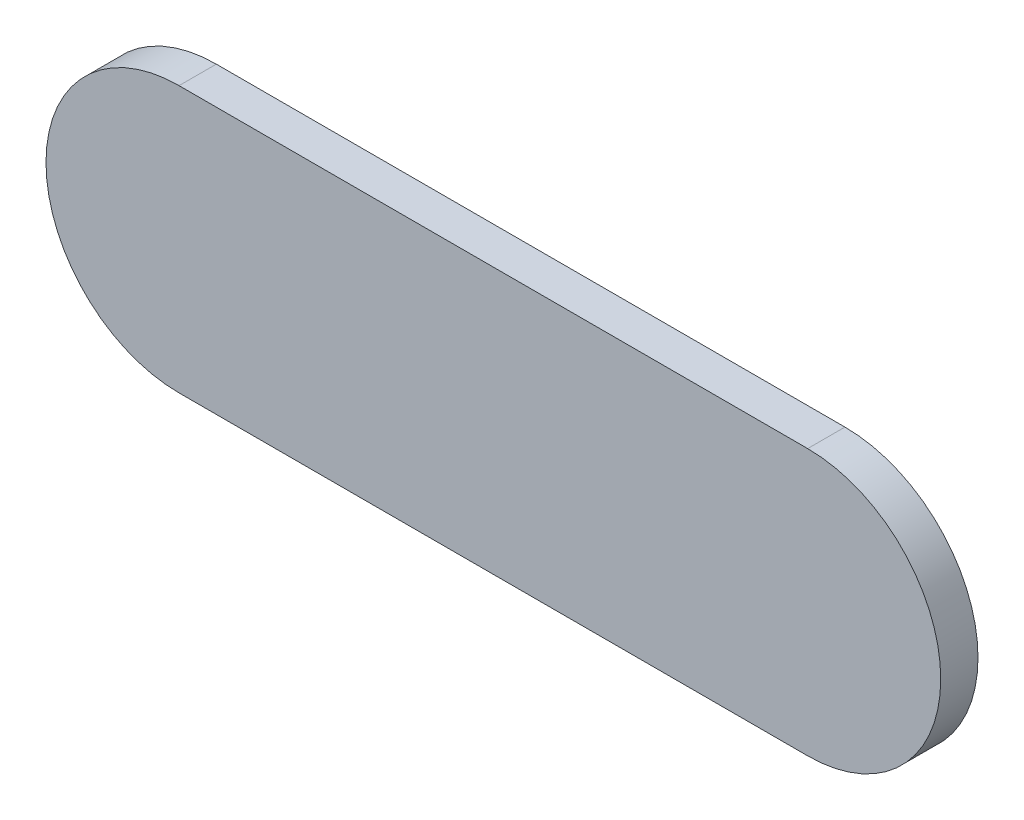
ISO-10303-21;
HEADER;
FILE_DESCRIPTION(('STEP AP214'),'2;1');
FILE_NAME('part.step','',(''),(''),'','','');
FILE_SCHEMA(('AUTOMOTIVE_DESIGN { 1 0 10303 214 1 1 1 1 }'));
ENDSEC;
DATA;
#1=APPLICATION_CONTEXT('core data for automotive mechanical design processes');
#2=APPLICATION_PROTOCOL_DEFINITION('international standard','automotive_design',2000,#1);
#3=PRODUCT_CONTEXT('',#1,'mechanical');
#4=PRODUCT('Part','Part','',(#3));
#5=PRODUCT_RELATED_PRODUCT_CATEGORY('part','',(#4));
#6=PRODUCT_DEFINITION_FORMATION('','',#4);
#7=PRODUCT_DEFINITION_CONTEXT('part definition',#1,'design');
#8=PRODUCT_DEFINITION('design','',#6,#7);
#9=PRODUCT_DEFINITION_SHAPE('','',#8);
#10=(LENGTH_UNIT() NAMED_UNIT(*) SI_UNIT(.MILLI.,.METRE.));
#11=(NAMED_UNIT(*) PLANE_ANGLE_UNIT() SI_UNIT($,.RADIAN.));
#12=(NAMED_UNIT(*) SI_UNIT($,.STERADIAN.) SOLID_ANGLE_UNIT());
#13=UNCERTAINTY_MEASURE_WITH_UNIT(LENGTH_MEASURE(1.E-05),#10,'distance_accuracy_value','');
#14=(GEOMETRIC_REPRESENTATION_CONTEXT(3) GLOBAL_UNCERTAINTY_ASSIGNED_CONTEXT((#13)) GLOBAL_UNIT_ASSIGNED_CONTEXT((#10,
#11,#12)) REPRESENTATION_CONTEXT('',''));
#15=CARTESIAN_POINT('',(0.,0.,0.));
#16=DIRECTION('',(0.,0.,1.));
#17=DIRECTION('',(1.,0.,0.));
#18=AXIS2_PLACEMENT_3D('',#15,#16,#17);
#19=CARTESIAN_POINT('',(96.9169512,57.8099936,0.));
#20=DIRECTION('',(0.,1.,0.));
#21=DIRECTION('',(1.,0.,0.));
#22=AXIS2_PLACEMENT_3D('',#19,#20,#21);
#23=PLANE('',#22);
#24=DIRECTION('',(1.,0.,0.));
#25=VECTOR('',#24,1.);
#26=CARTESIAN_POINT('',(96.9169512,57.8099936,0.03556));
#27=LINE('',#26,#25);
#28=CARTESIAN_POINT('',(96.9169512,57.8099936,0.03556));
#29=VERTEX_POINT('',#28);
#30=CARTESIAN_POINT('',(97.51695,57.8099936,0.03556));
#31=VERTEX_POINT('',#30);
#32=EDGE_CURVE('E11',#29,#31,#27,.T.);
#33=ORIENTED_EDGE('',*,*,#32,.F.);
#34=DIRECTION('',(0.,0.,1.));
#35=VECTOR('',#34,1.);
#36=CARTESIAN_POINT('',(96.9169512,57.8099936,0.));
#37=LINE('',#36,#35);
#38=CARTESIAN_POINT('',(96.9169512,57.8099936,0.));
#39=VERTEX_POINT('',#38);
#40=EDGE_CURVE('E24',#39,#29,#37,.T.);
#41=ORIENTED_EDGE('',*,*,#40,.F.);
#42=DIRECTION('',(1.,0.,0.));
#43=VECTOR('',#42,1.);
#44=CARTESIAN_POINT('',(96.9169512,57.8099936,0.));
#45=LINE('',#44,#43);
#46=CARTESIAN_POINT('',(97.51695,57.8099936,0.));
#47=VERTEX_POINT('',#46);
#48=EDGE_CURVE('E75',#39,#47,#45,.T.);
#49=ORIENTED_EDGE('',*,*,#48,.T.);
#50=DIRECTION('',(0.,0.,1.));
#51=VECTOR('',#50,1.);
#52=CARTESIAN_POINT('',(97.51695,57.8099936,0.));
#53=LINE('',#52,#51);
#54=EDGE_CURVE('E37',#47,#31,#53,.T.);
#55=ORIENTED_EDGE('',*,*,#54,.T.);
#56=EDGE_LOOP('',(#33,#41,#49,#55));
#57=FACE_BOUND('',#56,.T.);
#58=ADVANCED_FACE('F17',(#57),#23,.F.);
#59=CARTESIAN_POINT('',(97.51695,57.9369936,0.));
#60=DIRECTION('',(0.,0.,-1.));
#61=DIRECTION('',(-1.11896493820486E-13,-1.,0.));
#62=AXIS2_PLACEMENT_3D('',#59,#60,#61);
#63=CYLINDRICAL_SURFACE('',#62,0.126999999999998);
#64=CARTESIAN_POINT('',(97.51695,57.9369936,0.03556));
#65=DIRECTION('',(0.,0.,1.));
#66=DIRECTION('',(-1.11896493820486E-13,-1.,0.));
#67=AXIS2_PLACEMENT_3D('',#64,#65,#66);
#68=CIRCLE('',#67,0.126999999999998);
#69=CARTESIAN_POINT('',(97.51695,58.0639936,0.03556));
#70=VERTEX_POINT('',#69);
#71=EDGE_CURVE('E83',#31,#70,#68,.T.);
#72=ORIENTED_EDGE('',*,*,#71,.F.);
#73=ORIENTED_EDGE('',*,*,#54,.F.);
#74=CARTESIAN_POINT('',(97.51695,57.9369936,0.));
#75=DIRECTION('',(0.,0.,1.));
#76=DIRECTION('',(-1.11896493820486E-13,-1.,0.));
#77=AXIS2_PLACEMENT_3D('',#74,#75,#76);
#78=CIRCLE('',#77,0.126999999999998);
#79=CARTESIAN_POINT('',(97.51695,58.0639936,0.));
#80=VERTEX_POINT('',#79);
#81=EDGE_CURVE('E81',#47,#80,#78,.T.);
#82=ORIENTED_EDGE('',*,*,#81,.T.);
#83=DIRECTION('',(0.,0.,1.));
#84=VECTOR('',#83,1.);
#85=CARTESIAN_POINT('',(97.51695,58.0639936,0.));
#86=LINE('',#85,#84);
#87=EDGE_CURVE('E67',#80,#70,#86,.T.);
#88=ORIENTED_EDGE('',*,*,#87,.T.);
#89=EDGE_LOOP('',(#72,#73,#82,#88));
#90=FACE_BOUND('',#89,.T.);
#91=ADVANCED_FACE('F89',(#90),#63,.T.);
#92=CARTESIAN_POINT('',(97.51695,58.0639936,0.));
#93=DIRECTION('',(0.,-1.,0.));
#94=DIRECTION('',(-1.,0.,0.));
#95=AXIS2_PLACEMENT_3D('',#92,#93,#94);
#96=PLANE('',#95);
#97=DIRECTION('',(-1.,0.,0.));
#98=VECTOR('',#97,1.);
#99=CARTESIAN_POINT('',(97.51695,58.0639936,0.03556));
#100=LINE('',#99,#98);
#101=CARTESIAN_POINT('',(96.9169512,58.0639936,0.03556));
#102=VERTEX_POINT('',#101);
#103=EDGE_CURVE('E71',#70,#102,#100,.T.);
#104=ORIENTED_EDGE('',*,*,#103,.F.);
#105=ORIENTED_EDGE('',*,*,#87,.F.);
#106=DIRECTION('',(-1.,0.,0.));
#107=VECTOR('',#106,1.);
#108=CARTESIAN_POINT('',(97.51695,58.0639936,0.));
#109=LINE('',#108,#107);
#110=CARTESIAN_POINT('',(96.9169512,58.0639936,0.));
#111=VERTEX_POINT('',#110);
#112=EDGE_CURVE('E63',#80,#111,#109,.T.);
#113=ORIENTED_EDGE('',*,*,#112,.T.);
#114=DIRECTION('',(0.,0.,1.));
#115=VECTOR('',#114,1.);
#116=CARTESIAN_POINT('',(96.9169512,58.0639936,0.));
#117=LINE('',#116,#115);
#118=EDGE_CURVE('E53',#111,#102,#117,.T.);
#119=ORIENTED_EDGE('',*,*,#118,.T.);
#120=EDGE_LOOP('',(#104,#105,#113,#119));
#121=FACE_BOUND('',#120,.T.);
#122=ADVANCED_FACE('F66',(#121),#96,.F.);
#123=CARTESIAN_POINT('',(96.9169512,57.9369936,0.));
#124=DIRECTION('',(0.,0.,-1.));
#125=DIRECTION('',(0.,1.,0.));
#126=AXIS2_PLACEMENT_3D('',#123,#124,#125);
#127=CYLINDRICAL_SURFACE('',#126,0.126999999999998);
#128=CARTESIAN_POINT('',(96.9169512,57.9369936,0.03556));
#129=DIRECTION('',(0.,0.,1.));
#130=DIRECTION('',(0.,1.,0.));
#131=AXIS2_PLACEMENT_3D('',#128,#129,#130);
#132=CIRCLE('',#131,0.126999999999998);
#133=EDGE_CURVE('E59',#102,#29,#132,.T.);
#134=ORIENTED_EDGE('',*,*,#133,.F.);
#135=ORIENTED_EDGE('',*,*,#118,.F.);
#136=CARTESIAN_POINT('',(96.9169512,57.9369936,0.));
#137=DIRECTION('',(0.,0.,1.));
#138=DIRECTION('',(0.,1.,0.));
#139=AXIS2_PLACEMENT_3D('',#136,#137,#138);
#140=CIRCLE('',#139,0.126999999999998);
#141=EDGE_CURVE('E57',#111,#39,#140,.T.);
#142=ORIENTED_EDGE('',*,*,#141,.T.);
#143=ORIENTED_EDGE('',*,*,#40,.T.);
#144=EDGE_LOOP('',(#134,#135,#142,#143));
#145=FACE_BOUND('',#144,.T.);
#146=ADVANCED_FACE('F55',(#145),#127,.T.);
#147=CARTESIAN_POINT('',(96.9169512,57.8099936,0.));
#148=DIRECTION('',(0.,0.,-1.));
#149=DIRECTION('',(-1.,0.,0.));
#150=AXIS2_PLACEMENT_3D('',#147,#148,#149);
#151=PLANE('',#150);
#152=ORIENTED_EDGE('',*,*,#141,.F.);
#153=ORIENTED_EDGE('',*,*,#112,.F.);
#154=ORIENTED_EDGE('',*,*,#81,.F.);
#155=ORIENTED_EDGE('',*,*,#48,.F.);
#156=EDGE_LOOP('',(#152,#153,#154,#155));
#157=FACE_BOUND('',#156,.T.);
#158=ADVANCED_FACE('F74',(#157),#151,.T.);
#159=CARTESIAN_POINT('',(96.9169512,57.8099936,0.03556));
#160=DIRECTION('',(0.,0.,-1.));
#161=DIRECTION('',(-1.,0.,0.));
#162=AXIS2_PLACEMENT_3D('',#159,#160,#161);
#163=PLANE('',#162);
#164=ORIENTED_EDGE('',*,*,#32,.T.);
#165=ORIENTED_EDGE('',*,*,#71,.T.);
#166=ORIENTED_EDGE('',*,*,#103,.T.);
#167=ORIENTED_EDGE('',*,*,#133,.T.);
#168=EDGE_LOOP('',(#164,#165,#166,#167));
#169=FACE_BOUND('',#168,.T.);
#170=ADVANCED_FACE('F91',(#169),#163,.F.);
#171=CLOSED_SHELL('',(#58,#91,#122,#146,#158,#170));
#172=MANIFOLD_SOLID_BREP('B1',#171);
#173=ADVANCED_BREP_SHAPE_REPRESENTATION('',(#18,#172),#14);
#174=SHAPE_DEFINITION_REPRESENTATION(#9,#173);
ENDSEC;
END-ISO-10303-21;
